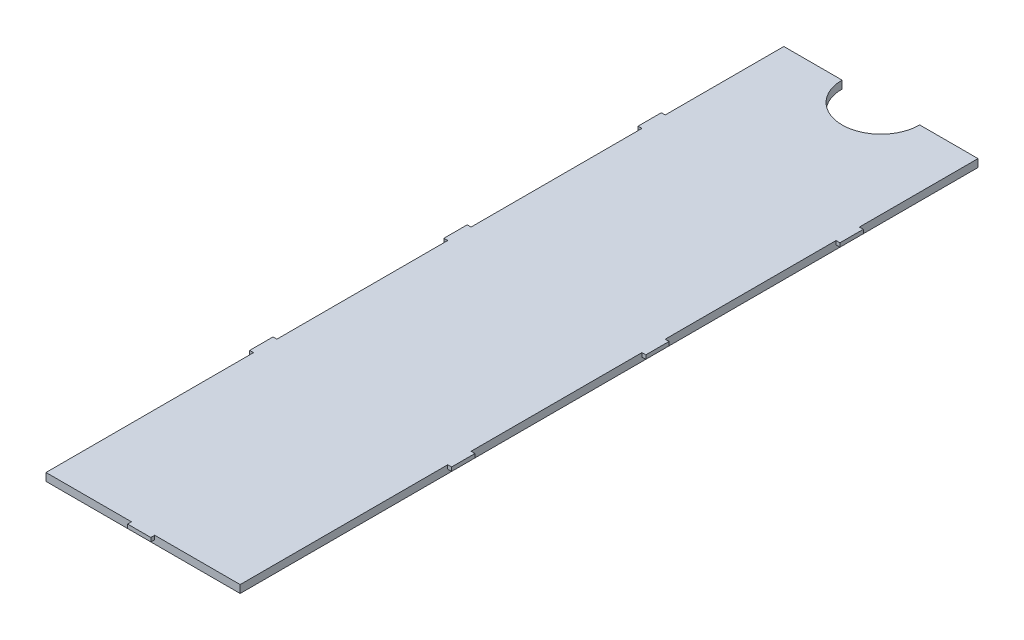
ISO-10303-21;
HEADER;
FILE_DESCRIPTION(('STEP AP214'),'2;1');
FILE_NAME('part.step','',(''),(''),'','','');
FILE_SCHEMA(('AUTOMOTIVE_DESIGN { 1 0 10303 214 1 1 1 1 }'));
ENDSEC;
DATA;
#1=APPLICATION_CONTEXT('core data for automotive mechanical design processes');
#2=APPLICATION_PROTOCOL_DEFINITION('international standard','automotive_design',2000,#1);
#3=PRODUCT_CONTEXT('',#1,'mechanical');
#4=PRODUCT('Part','Part','',(#3));
#5=PRODUCT_RELATED_PRODUCT_CATEGORY('part','',(#4));
#6=PRODUCT_DEFINITION_FORMATION('','',#4);
#7=PRODUCT_DEFINITION_CONTEXT('part definition',#1,'design');
#8=PRODUCT_DEFINITION('design','',#6,#7);
#9=PRODUCT_DEFINITION_SHAPE('','',#8);
#10=(LENGTH_UNIT() NAMED_UNIT(*) SI_UNIT(.MILLI.,.METRE.));
#11=(NAMED_UNIT(*) PLANE_ANGLE_UNIT() SI_UNIT($,.RADIAN.));
#12=(NAMED_UNIT(*) SI_UNIT($,.STERADIAN.) SOLID_ANGLE_UNIT());
#13=UNCERTAINTY_MEASURE_WITH_UNIT(LENGTH_MEASURE(1.E-05),#10,'distance_accuracy_value','');
#14=(GEOMETRIC_REPRESENTATION_CONTEXT(3) GLOBAL_UNCERTAINTY_ASSIGNED_CONTEXT((#13)) GLOBAL_UNIT_ASSIGNED_CONTEXT((#10,
#11,#12)) REPRESENTATION_CONTEXT('',''));
#15=CARTESIAN_POINT('',(0.,0.,0.));
#16=DIRECTION('',(0.,0.,1.));
#17=DIRECTION('',(1.,0.,0.));
#18=AXIS2_PLACEMENT_3D('',#15,#16,#17);
#19=CARTESIAN_POINT('',(0.,35.274050100301,1.80750317688863));
#20=DIRECTION('',(0.,0.,1.));
#21=DIRECTION('',(1.,0.,0.));
#22=AXIS2_PLACEMENT_3D('',#19,#20,#21);
#23=PLANE('',#22);
#24=DIRECTION('',(-1.,0.,0.));
#25=VECTOR('',#24,1.);
#26=CARTESIAN_POINT('',(0.,35.274050100301,1.80750317688863));
#27=LINE('',#26,#25);
#28=CARTESIAN_POINT('',(-86.6012572167533,35.274050100301,1.80750317688863));
#29=VERTEX_POINT('',#28);
#30=CARTESIAN_POINT('',(-94.1012572167536,35.274050100301,1.80750317688863));
#31=VERTEX_POINT('',#30);
#32=EDGE_CURVE('E284',#29,#31,#27,.T.);
#33=ORIENTED_EDGE('',*,*,#32,.F.);
#34=DIRECTION('',(0.,-1.,0.));
#35=VECTOR('',#34,1.);
#36=CARTESIAN_POINT('',(-86.6012572167533,35.274050100301,1.80750317688863));
#37=LINE('',#36,#35);
#38=CARTESIAN_POINT('',(-86.6012572167533,34.274050100301,1.80750317688863));
#39=VERTEX_POINT('',#38);
#40=EDGE_CURVE('E264',#29,#39,#37,.T.);
#41=ORIENTED_EDGE('',*,*,#40,.T.);
#42=DIRECTION('',(-1.,0.,0.));
#43=VECTOR('',#42,1.);
#44=CARTESIAN_POINT('',(0.,34.274050100301,1.80750317688863));
#45=LINE('',#44,#43);
#46=CARTESIAN_POINT('',(-94.1012572167536,34.274050100301,1.80750317688863));
#47=VERTEX_POINT('',#46);
#48=EDGE_CURVE('E303',#39,#47,#45,.T.);
#49=ORIENTED_EDGE('',*,*,#48,.T.);
#50=DIRECTION('',(0.,-1.,0.));
#51=VECTOR('',#50,1.);
#52=CARTESIAN_POINT('',(-94.1012572167536,35.274050100301,1.80750317688863));
#53=LINE('',#52,#51);
#54=EDGE_CURVE('E299',#31,#47,#53,.T.);
#55=ORIENTED_EDGE('',*,*,#54,.F.);
#56=EDGE_LOOP('',(#33,#41,#49,#55));
#57=FACE_BOUND('',#56,.T.);
#58=ADVANCED_FACE('F41',(#57),#23,.F.);
#59=CARTESIAN_POINT('',(-94.1012572167536,35.274050100301,0.));
#60=DIRECTION('',(1.,0.,0.));
#61=DIRECTION('',(0.,0.,-1.));
#62=AXIS2_PLACEMENT_3D('',#59,#60,#61);
#63=PLANE('',#62);
#64=DIRECTION('',(0.,0.,-1.));
#65=VECTOR('',#64,1.);
#66=CARTESIAN_POINT('',(-94.1012572167536,34.774050100301,0.));
#67=LINE('',#66,#65);
#68=CARTESIAN_POINT('',(-94.1012572167536,34.774050100301,20.0802620856482));
#69=VERTEX_POINT('',#68);
#70=CARTESIAN_POINT('',(-94.1012572167536,34.774050100301,17.0802620856482));
#71=VERTEX_POINT('',#70);
#72=EDGE_CURVE('E333',#69,#71,#67,.T.);
#73=ORIENTED_EDGE('',*,*,#72,.T.);
#74=DIRECTION('',(0.,1.,0.));
#75=VECTOR('',#74,1.);
#76=CARTESIAN_POINT('',(-94.1012572167536,35.274050100301,17.0802620856482));
#77=LINE('',#76,#75);
#78=CARTESIAN_POINT('',(-94.1012572167536,35.274050100301,17.0802620856482));
#79=VERTEX_POINT('',#78);
#80=EDGE_CURVE('E399',#71,#79,#77,.T.);
#81=ORIENTED_EDGE('',*,*,#80,.T.);
#82=DIRECTION('',(0.,0.,1.));
#83=VECTOR('',#82,1.);
#84=CARTESIAN_POINT('',(-94.1012572167536,35.274050100301,0.));
#85=LINE('',#84,#83);
#86=EDGE_CURVE('E289',#31,#79,#85,.T.);
#87=ORIENTED_EDGE('',*,*,#86,.F.);
#88=ORIENTED_EDGE('',*,*,#54,.T.);
#89=DIRECTION('',(0.,0.,1.));
#90=VECTOR('',#89,1.);
#91=CARTESIAN_POINT('',(-94.1012572167536,34.274050100301,0.));
#92=LINE('',#91,#90);
#93=CARTESIAN_POINT('',(-94.1012572167536,34.274050100301,96.8075031768886));
#94=VERTEX_POINT('',#93);
#95=EDGE_CURVE('E300',#47,#94,#92,.T.);
#96=ORIENTED_EDGE('',*,*,#95,.T.);
#97=DIRECTION('',(0.,-1.,0.));
#98=VECTOR('',#97,1.);
#99=CARTESIAN_POINT('',(-94.1012572167536,35.274050100301,96.8075031768886));
#100=LINE('',#99,#98);
#101=CARTESIAN_POINT('',(-94.1012572167536,35.274050100301,96.8075031768886));
#102=VERTEX_POINT('',#101);
#103=EDGE_CURVE('E311',#102,#94,#100,.T.);
#104=ORIENTED_EDGE('',*,*,#103,.F.);
#105=CARTESIAN_POINT('',(-94.1012572167536,35.274050100301,70.0802620856482));
#106=VERTEX_POINT('',#105);
#107=EDGE_CURVE('E310',#106,#102,#85,.T.);
#108=ORIENTED_EDGE('',*,*,#107,.F.);
#109=DIRECTION('',(0.,-1.,0.));
#110=VECTOR('',#109,1.);
#111=CARTESIAN_POINT('',(-94.1012572167536,35.274050100301,70.0802620856482));
#112=LINE('',#111,#110);
#113=CARTESIAN_POINT('',(-94.1012572167536,34.774050100301,70.0802620856482));
#114=VERTEX_POINT('',#113);
#115=EDGE_CURVE('E442',#106,#114,#112,.T.);
#116=ORIENTED_EDGE('',*,*,#115,.T.);
#117=DIRECTION('',(0.,0.,-1.));
#118=VECTOR('',#117,1.);
#119=CARTESIAN_POINT('',(-94.1012572167536,34.774050100301,0.));
#120=LINE('',#119,#118);
#121=CARTESIAN_POINT('',(-94.1012572167536,34.774050100301,67.0802620856482));
#122=VERTEX_POINT('',#121);
#123=EDGE_CURVE('E327',#114,#122,#120,.T.);
#124=ORIENTED_EDGE('',*,*,#123,.T.);
#125=DIRECTION('',(0.,1.,0.));
#126=VECTOR('',#125,1.);
#127=CARTESIAN_POINT('',(-94.1012572167536,35.274050100301,67.0802620856482));
#128=LINE('',#127,#126);
#129=CARTESIAN_POINT('',(-94.1012572167536,35.274050100301,67.0802620856482));
#130=VERTEX_POINT('',#129);
#131=EDGE_CURVE('E451',#122,#130,#128,.T.);
#132=ORIENTED_EDGE('',*,*,#131,.T.);
#133=CARTESIAN_POINT('',(-94.1012572167536,35.274050100301,45.0802620856482));
#134=VERTEX_POINT('',#133);
#135=EDGE_CURVE('E564',#134,#130,#85,.T.);
#136=ORIENTED_EDGE('',*,*,#135,.F.);
#137=DIRECTION('',(0.,-1.,0.));
#138=VECTOR('',#137,1.);
#139=CARTESIAN_POINT('',(-94.1012572167536,35.274050100301,45.0802620856482));
#140=LINE('',#139,#138);
#141=CARTESIAN_POINT('',(-94.1012572167536,34.774050100301,45.0802620856482));
#142=VERTEX_POINT('',#141);
#143=EDGE_CURVE('E416',#134,#142,#140,.T.);
#144=ORIENTED_EDGE('',*,*,#143,.T.);
#145=DIRECTION('',(0.,0.,-1.));
#146=VECTOR('',#145,1.);
#147=CARTESIAN_POINT('',(-94.1012572167536,34.774050100301,0.));
#148=LINE('',#147,#146);
#149=CARTESIAN_POINT('',(-94.1012572167536,34.774050100301,42.0802620856482));
#150=VERTEX_POINT('',#149);
#151=EDGE_CURVE('E330',#142,#150,#148,.T.);
#152=ORIENTED_EDGE('',*,*,#151,.T.);
#153=DIRECTION('',(0.,1.,0.));
#154=VECTOR('',#153,1.);
#155=CARTESIAN_POINT('',(-94.1012572167536,35.274050100301,42.0802620856482));
#156=LINE('',#155,#154);
#157=CARTESIAN_POINT('',(-94.1012572167536,35.274050100301,42.0802620856482));
#158=VERTEX_POINT('',#157);
#159=EDGE_CURVE('E425',#150,#158,#156,.T.);
#160=ORIENTED_EDGE('',*,*,#159,.T.);
#161=CARTESIAN_POINT('',(-94.1012572167536,35.274050100301,20.0802620856482));
#162=VERTEX_POINT('',#161);
#163=EDGE_CURVE('E563',#162,#158,#85,.T.);
#164=ORIENTED_EDGE('',*,*,#163,.F.);
#165=DIRECTION('',(0.,-1.,0.));
#166=VECTOR('',#165,1.);
#167=CARTESIAN_POINT('',(-94.1012572167536,35.274050100301,20.0802620856482));
#168=LINE('',#167,#166);
#169=EDGE_CURVE('E391',#162,#69,#168,.T.);
#170=ORIENTED_EDGE('',*,*,#169,.T.);
#171=EDGE_LOOP('',(#73,#81,#87,#88,#96,#104,#108,#116,#124,#132,#136,#144,#152,#160,#164,#170));
#172=FACE_BOUND('',#171,.T.);
#173=ADVANCED_FACE('F43',(#172),#63,.F.);
#174=CARTESIAN_POINT('',(0.,35.274050100301,96.8075031768886));
#175=DIRECTION('',(0.,0.,-1.));
#176=DIRECTION('',(-1.,0.,0.));
#177=AXIS2_PLACEMENT_3D('',#174,#175,#176);
#178=PLANE('',#177);
#179=DIRECTION('',(1.,0.,0.));
#180=VECTOR('',#179,1.);
#181=CARTESIAN_POINT('',(0.,35.274050100301,96.8075031768886));
#182=LINE('',#181,#180);
#183=CARTESIAN_POINT('',(-80.1012572167533,35.274050100301,96.8075031768886));
#184=VERTEX_POINT('',#183);
#185=CARTESIAN_POINT('',(-69.1012572167529,35.274050100301,96.8075031768886));
#186=VERTEX_POINT('',#185);
#187=EDGE_CURVE('E294',#184,#186,#182,.T.);
#188=ORIENTED_EDGE('',*,*,#187,.F.);
#189=DIRECTION('',(0.,-1.,0.));
#190=VECTOR('',#189,1.);
#191=CARTESIAN_POINT('',(-80.1012572167533,35.274050100301,96.8075031768886));
#192=LINE('',#191,#190);
#193=CARTESIAN_POINT('',(-80.1012572167533,34.774050100301,96.8075031768886));
#194=VERTEX_POINT('',#193);
#195=EDGE_CURVE('E476',#184,#194,#192,.T.);
#196=ORIENTED_EDGE('',*,*,#195,.T.);
#197=DIRECTION('',(-1.,0.,0.));
#198=VECTOR('',#197,1.);
#199=CARTESIAN_POINT('',(0.,34.774050100301,96.8075031768886));
#200=LINE('',#199,#198);
#201=CARTESIAN_POINT('',(-83.1012572167533,34.774050100301,96.8075031768886));
#202=VERTEX_POINT('',#201);
#203=EDGE_CURVE('E324',#194,#202,#200,.T.);
#204=ORIENTED_EDGE('',*,*,#203,.T.);
#205=DIRECTION('',(0.,1.,0.));
#206=VECTOR('',#205,1.);
#207=CARTESIAN_POINT('',(-83.1012572167533,35.274050100301,96.8075031768886));
#208=LINE('',#207,#206);
#209=CARTESIAN_POINT('',(-83.1012572167533,35.274050100301,96.8075031768886));
#210=VERTEX_POINT('',#209);
#211=EDGE_CURVE('E468',#202,#210,#208,.T.);
#212=ORIENTED_EDGE('',*,*,#211,.T.);
#213=EDGE_CURVE('E296',#102,#210,#182,.T.);
#214=ORIENTED_EDGE('',*,*,#213,.F.);
#215=ORIENTED_EDGE('',*,*,#103,.T.);
#216=DIRECTION('',(1.,0.,0.));
#217=VECTOR('',#216,1.);
#218=CARTESIAN_POINT('',(0.,34.274050100301,96.8075031768886));
#219=LINE('',#218,#217);
#220=CARTESIAN_POINT('',(-69.1012572167529,34.274050100301,96.8075031768886));
#221=VERTEX_POINT('',#220);
#222=EDGE_CURVE('E308',#94,#221,#219,.T.);
#223=ORIENTED_EDGE('',*,*,#222,.T.);
#224=DIRECTION('',(0.,-1.,0.));
#225=VECTOR('',#224,1.);
#226=CARTESIAN_POINT('',(-69.1012572167529,35.274050100301,96.8075031768886));
#227=LINE('',#226,#225);
#228=EDGE_CURVE('E315',#186,#221,#227,.T.);
#229=ORIENTED_EDGE('',*,*,#228,.F.);
#230=EDGE_LOOP('',(#188,#196,#204,#212,#214,#215,#223,#229));
#231=FACE_BOUND('',#230,.T.);
#232=ADVANCED_FACE('F603',(#231),#178,.F.);
#233=CARTESIAN_POINT('',(-69.1012572167529,35.274050100301,0.));
#234=DIRECTION('',(-1.,0.,0.));
#235=DIRECTION('',(0.,0.,1.));
#236=AXIS2_PLACEMENT_3D('',#233,#234,#235);
#237=PLANE('',#236);
#238=DIRECTION('',(0.,0.,-1.));
#239=VECTOR('',#238,1.);
#240=CARTESIAN_POINT('',(-69.1012572167529,35.274050100301,0.));
#241=LINE('',#240,#239);
#242=CARTESIAN_POINT('',(-69.1012572167529,35.274050100301,67.0802620856482));
#243=VERTEX_POINT('',#242);
#244=CARTESIAN_POINT('',(-69.1012572167529,35.274050100301,45.0802620856482));
#245=VERTEX_POINT('',#244);
#246=EDGE_CURVE('E295',#243,#245,#241,.T.);
#247=ORIENTED_EDGE('',*,*,#246,.F.);
#248=DIRECTION('',(0.,-1.,0.));
#249=VECTOR('',#248,1.);
#250=CARTESIAN_POINT('',(-69.1012572167529,35.274050100301,67.0802620856482));
#251=LINE('',#250,#249);
#252=CARTESIAN_POINT('',(-69.1012572167529,34.774050100301,67.0802620856482));
#253=VERTEX_POINT('',#252);
#254=EDGE_CURVE('E526',#243,#253,#251,.T.);
#255=ORIENTED_EDGE('',*,*,#254,.T.);
#256=DIRECTION('',(0.,0.,1.));
#257=VECTOR('',#256,1.);
#258=CARTESIAN_POINT('',(-69.1012572167529,34.774050100301,0.));
#259=LINE('',#258,#257);
#260=CARTESIAN_POINT('',(-69.1012572167529,34.774050100301,70.0802620856482));
#261=VERTEX_POINT('',#260);
#262=EDGE_CURVE('E11',#253,#261,#259,.T.);
#263=ORIENTED_EDGE('',*,*,#262,.T.);
#264=DIRECTION('',(0.,1.,0.));
#265=VECTOR('',#264,1.);
#266=CARTESIAN_POINT('',(-69.1012572167529,35.274050100301,70.0802620856482));
#267=LINE('',#266,#265);
#268=CARTESIAN_POINT('',(-69.1012572167529,35.274050100301,70.0802620856482));
#269=VERTEX_POINT('',#268);
#270=EDGE_CURVE('E529',#261,#269,#267,.T.);
#271=ORIENTED_EDGE('',*,*,#270,.T.);
#272=EDGE_CURVE('E288',#186,#269,#241,.T.);
#273=ORIENTED_EDGE('',*,*,#272,.F.);
#274=ORIENTED_EDGE('',*,*,#228,.T.);
#275=DIRECTION('',(0.,0.,-1.));
#276=VECTOR('',#275,1.);
#277=CARTESIAN_POINT('',(-69.1012572167529,34.274050100301,0.));
#278=LINE('',#277,#276);
#279=CARTESIAN_POINT('',(-69.1012572167529,34.274050100301,1.80750317688863));
#280=VERTEX_POINT('',#279);
#281=EDGE_CURVE('E306',#221,#280,#278,.T.);
#282=ORIENTED_EDGE('',*,*,#281,.T.);
#283=DIRECTION('',(0.,-1.,0.));
#284=VECTOR('',#283,1.);
#285=CARTESIAN_POINT('',(-69.1012572167529,35.274050100301,1.80750317688863));
#286=LINE('',#285,#284);
#287=CARTESIAN_POINT('',(-69.1012572167529,35.274050100301,1.80750317688863));
#288=VERTEX_POINT('',#287);
#289=EDGE_CURVE('E318',#288,#280,#286,.T.);
#290=ORIENTED_EDGE('',*,*,#289,.F.);
#291=CARTESIAN_POINT('',(-69.1012572167529,35.274050100301,17.0802620856482));
#292=VERTEX_POINT('',#291);
#293=EDGE_CURVE('E282',#292,#288,#241,.T.);
#294=ORIENTED_EDGE('',*,*,#293,.F.);
#295=DIRECTION('',(0.,-1.,0.));
#296=VECTOR('',#295,1.);
#297=CARTESIAN_POINT('',(-69.1012572167529,35.274050100301,17.0802620856482));
#298=LINE('',#297,#296);
#299=CARTESIAN_POINT('',(-69.1012572167529,34.774050100301,17.0802620856482));
#300=VERTEX_POINT('',#299);
#301=EDGE_CURVE('E304',#292,#300,#298,.T.);
#302=ORIENTED_EDGE('',*,*,#301,.T.);
#303=DIRECTION('',(0.,0.,1.));
#304=VECTOR('',#303,1.);
#305=CARTESIAN_POINT('',(-69.1012572167529,34.774050100301,0.));
#306=LINE('',#305,#304);
#307=CARTESIAN_POINT('',(-69.1012572167529,34.774050100301,20.0802620856482));
#308=VERTEX_POINT('',#307);
#309=EDGE_CURVE('E314',#300,#308,#306,.T.);
#310=ORIENTED_EDGE('',*,*,#309,.T.);
#311=DIRECTION('',(0.,1.,0.));
#312=VECTOR('',#311,1.);
#313=CARTESIAN_POINT('',(-69.1012572167529,35.274050100301,20.0802620856482));
#314=LINE('',#313,#312);
#315=CARTESIAN_POINT('',(-69.1012572167529,35.274050100301,20.0802620856482));
#316=VERTEX_POINT('',#315);
#317=EDGE_CURVE('E498',#308,#316,#314,.T.);
#318=ORIENTED_EDGE('',*,*,#317,.T.);
#319=CARTESIAN_POINT('',(-69.1012572167529,35.274050100301,42.0802620856482));
#320=VERTEX_POINT('',#319);
#321=EDGE_CURVE('E286',#320,#316,#241,.T.);
#322=ORIENTED_EDGE('',*,*,#321,.F.);
#323=DIRECTION('',(0.,-1.,0.));
#324=VECTOR('',#323,1.);
#325=CARTESIAN_POINT('',(-69.1012572167529,35.274050100301,42.0802620856482));
#326=LINE('',#325,#324);
#327=CARTESIAN_POINT('',(-69.1012572167529,34.774050100301,42.0802620856482));
#328=VERTEX_POINT('',#327);
#329=EDGE_CURVE('E344',#320,#328,#326,.T.);
#330=ORIENTED_EDGE('',*,*,#329,.T.);
#331=DIRECTION('',(0.,0.,1.));
#332=VECTOR('',#331,1.);
#333=CARTESIAN_POINT('',(-69.1012572167529,34.774050100301,0.));
#334=LINE('',#333,#332);
#335=CARTESIAN_POINT('',(-69.1012572167529,34.774050100301,45.0802620856482));
#336=VERTEX_POINT('',#335);
#337=EDGE_CURVE('E49',#328,#336,#334,.T.);
#338=ORIENTED_EDGE('',*,*,#337,.T.);
#339=DIRECTION('',(0.,1.,0.));
#340=VECTOR('',#339,1.);
#341=CARTESIAN_POINT('',(-69.1012572167529,35.274050100301,45.0802620856482));
#342=LINE('',#341,#340);
#343=EDGE_CURVE('E342',#336,#245,#342,.T.);
#344=ORIENTED_EDGE('',*,*,#343,.T.);
#345=EDGE_LOOP('',(#247,#255,#263,#271,#273,#274,#282,#290,#294,#302,#310,#318,#322,#330,#338,#344));
#346=FACE_BOUND('',#345,.T.);
#347=ADVANCED_FACE('F340',(#346),#237,.F.);
#348=CARTESIAN_POINT('',(-76.6012572167533,34.274050100301,1.80750317688863));
#349=VERTEX_POINT('',#348);
#350=EDGE_CURVE('E277',#280,#349,#45,.T.);
#351=ORIENTED_EDGE('',*,*,#350,.T.);
#352=DIRECTION('',(0.,-1.,0.));
#353=VECTOR('',#352,1.);
#354=CARTESIAN_POINT('',(-76.6012572167533,35.274050100301,1.80750317688863));
#355=LINE('',#354,#353);
#356=CARTESIAN_POINT('',(-76.6012572167533,35.274050100301,1.80750317688863));
#357=VERTEX_POINT('',#356);
#358=EDGE_CURVE('E56',#349,#357,#355,.F.);
#359=ORIENTED_EDGE('',*,*,#358,.T.);
#360=EDGE_CURVE('E275',#288,#357,#27,.T.);
#361=ORIENTED_EDGE('',*,*,#360,.F.);
#362=ORIENTED_EDGE('',*,*,#289,.T.);
#363=EDGE_LOOP('',(#351,#359,#361,#362));
#364=FACE_BOUND('',#363,.T.);
#365=ADVANCED_FACE('F273',(#364),#23,.F.);
#366=CARTESIAN_POINT('',(0.,35.274050100301,0.));
#367=DIRECTION('',(0.,-1.,0.));
#368=DIRECTION('',(0.,0.,-1.));
#369=AXIS2_PLACEMENT_3D('',#366,#367,#368);
#370=PLANE('',#369);
#371=ORIENTED_EDGE('',*,*,#360,.T.);
#372=CARTESIAN_POINT('',(-81.6012572167533,35.274050100301,1.80750317688863));
#373=DIRECTION('',(0.,-1.,0.));
#374=DIRECTION('',(0.,0.,-1.));
#375=AXIS2_PLACEMENT_3D('',#372,#373,#374);
#376=CIRCLE('',#375,5.);
#377=EDGE_CURVE('E261',#357,#29,#376,.T.);
#378=ORIENTED_EDGE('',*,*,#377,.T.);
#379=ORIENTED_EDGE('',*,*,#32,.T.);
#380=ORIENTED_EDGE('',*,*,#86,.T.);
#381=DIRECTION('',(1.,0.,0.));
#382=VECTOR('',#381,1.);
#383=CARTESIAN_POINT('',(-94.6012572167536,35.274050100301,17.0802620856482));
#384=LINE('',#383,#382);
#385=CARTESIAN_POINT('',(-94.6012572167536,35.274050100301,17.0802620856482));
#386=VERTEX_POINT('',#385);
#387=EDGE_CURVE('E387',#386,#79,#384,.T.);
#388=ORIENTED_EDGE('',*,*,#387,.F.);
#389=DIRECTION('',(0.,0.,-1.));
#390=VECTOR('',#389,1.);
#391=CARTESIAN_POINT('',(-94.6012572167536,35.274050100301,17.0802620856482));
#392=LINE('',#391,#390);
#393=CARTESIAN_POINT('',(-94.6012572167536,35.274050100301,20.0802620856482));
#394=VERTEX_POINT('',#393);
#395=EDGE_CURVE('E381',#394,#386,#392,.T.);
#396=ORIENTED_EDGE('',*,*,#395,.F.);
#397=DIRECTION('',(-1.,0.,0.));
#398=VECTOR('',#397,1.);
#399=CARTESIAN_POINT('',(-94.6012572167536,35.274050100301,20.0802620856482));
#400=LINE('',#399,#398);
#401=EDGE_CURVE('E394',#162,#394,#400,.T.);
#402=ORIENTED_EDGE('',*,*,#401,.F.);
#403=ORIENTED_EDGE('',*,*,#163,.T.);
#404=DIRECTION('',(1.,0.,0.));
#405=VECTOR('',#404,1.);
#406=CARTESIAN_POINT('',(-94.6012572167536,35.274050100301,42.0802620856482));
#407=LINE('',#406,#405);
#408=CARTESIAN_POINT('',(-94.6012572167536,35.274050100301,42.0802620856482));
#409=VERTEX_POINT('',#408);
#410=EDGE_CURVE('E412',#409,#158,#407,.T.);
#411=ORIENTED_EDGE('',*,*,#410,.F.);
#412=DIRECTION('',(0.,0.,-1.));
#413=VECTOR('',#412,1.);
#414=CARTESIAN_POINT('',(-94.6012572167536,35.274050100301,42.0802620856482));
#415=LINE('',#414,#413);
#416=CARTESIAN_POINT('',(-94.6012572167536,35.274050100301,45.0802620856482));
#417=VERTEX_POINT('',#416);
#418=EDGE_CURVE('E406',#417,#409,#415,.T.);
#419=ORIENTED_EDGE('',*,*,#418,.F.);
#420=DIRECTION('',(-1.,0.,0.));
#421=VECTOR('',#420,1.);
#422=CARTESIAN_POINT('',(-94.6012572167536,35.274050100301,45.0802620856482));
#423=LINE('',#422,#421);
#424=EDGE_CURVE('E419',#134,#417,#423,.T.);
#425=ORIENTED_EDGE('',*,*,#424,.F.);
#426=ORIENTED_EDGE('',*,*,#135,.T.);
#427=DIRECTION('',(1.,0.,0.));
#428=VECTOR('',#427,1.);
#429=CARTESIAN_POINT('',(-94.6012572167536,35.274050100301,67.0802620856482));
#430=LINE('',#429,#428);
#431=CARTESIAN_POINT('',(-94.6012572167536,35.274050100301,67.0802620856482));
#432=VERTEX_POINT('',#431);
#433=EDGE_CURVE('E438',#432,#130,#430,.T.);
#434=ORIENTED_EDGE('',*,*,#433,.F.);
#435=DIRECTION('',(0.,0.,-1.));
#436=VECTOR('',#435,1.);
#437=CARTESIAN_POINT('',(-94.6012572167536,35.274050100301,67.0802620856482));
#438=LINE('',#437,#436);
#439=CARTESIAN_POINT('',(-94.6012572167536,35.274050100301,70.0802620856482));
#440=VERTEX_POINT('',#439);
#441=EDGE_CURVE('E432',#440,#432,#438,.T.);
#442=ORIENTED_EDGE('',*,*,#441,.F.);
#443=DIRECTION('',(-1.,0.,0.));
#444=VECTOR('',#443,1.);
#445=CARTESIAN_POINT('',(-94.6012572167536,35.274050100301,70.0802620856482));
#446=LINE('',#445,#444);
#447=EDGE_CURVE('E445',#106,#440,#446,.T.);
#448=ORIENTED_EDGE('',*,*,#447,.F.);
#449=ORIENTED_EDGE('',*,*,#107,.T.);
#450=ORIENTED_EDGE('',*,*,#213,.T.);
#451=DIRECTION('',(0.,0.,-1.));
#452=VECTOR('',#451,1.);
#453=CARTESIAN_POINT('',(-83.1012572167533,35.274050100301,96.3075031768883));
#454=LINE('',#453,#452);
#455=CARTESIAN_POINT('',(-83.1012572167533,35.274050100301,97.3075031768886));
#456=VERTEX_POINT('',#455);
#457=EDGE_CURVE('E458',#456,#210,#454,.T.);
#458=ORIENTED_EDGE('',*,*,#457,.F.);
#459=DIRECTION('',(-1.,0.,0.));
#460=VECTOR('',#459,1.);
#461=CARTESIAN_POINT('',(-80.1012572167533,35.274050100301,97.3075031768886));
#462=LINE('',#461,#460);
#463=CARTESIAN_POINT('',(-80.1012572167533,35.274050100301,97.3075031768886));
#464=VERTEX_POINT('',#463);
#465=EDGE_CURVE('E470',#464,#456,#462,.T.);
#466=ORIENTED_EDGE('',*,*,#465,.F.);
#467=DIRECTION('',(0.,0.,1.));
#468=VECTOR('',#467,1.);
#469=CARTESIAN_POINT('',(-80.1012572167533,35.274050100301,96.3075031768883));
#470=LINE('',#469,#468);
#471=EDGE_CURVE('E463',#184,#464,#470,.T.);
#472=ORIENTED_EDGE('',*,*,#471,.F.);
#473=ORIENTED_EDGE('',*,*,#187,.T.);
#474=ORIENTED_EDGE('',*,*,#272,.T.);
#475=DIRECTION('',(-1.,0.,0.));
#476=VECTOR('',#475,1.);
#477=CARTESIAN_POINT('',(-68.6012572167529,35.274050100301,70.0802620856482));
#478=LINE('',#477,#476);
#479=CARTESIAN_POINT('',(-68.6012572167529,35.274050100301,70.0802620856482));
#480=VERTEX_POINT('',#479);
#481=EDGE_CURVE('E537',#480,#269,#478,.T.);
#482=ORIENTED_EDGE('',*,*,#481,.F.);
#483=DIRECTION('',(0.,0.,1.));
#484=VECTOR('',#483,1.);
#485=CARTESIAN_POINT('',(-68.6012572167529,35.274050100301,67.0802620856482));
#486=LINE('',#485,#484);
#487=CARTESIAN_POINT('',(-68.6012572167529,35.274050100301,67.0802620856482));
#488=VERTEX_POINT('',#487);
#489=EDGE_CURVE('E533',#488,#480,#486,.T.);
#490=ORIENTED_EDGE('',*,*,#489,.F.);
#491=DIRECTION('',(1.,0.,0.));
#492=VECTOR('',#491,1.);
#493=CARTESIAN_POINT('',(-68.6012572167529,35.274050100301,67.0802620856482));
#494=LINE('',#493,#492);
#495=EDGE_CURVE('E521',#243,#488,#494,.T.);
#496=ORIENTED_EDGE('',*,*,#495,.F.);
#497=ORIENTED_EDGE('',*,*,#246,.T.);
#498=DIRECTION('',(-1.,0.,0.));
#499=VECTOR('',#498,1.);
#500=CARTESIAN_POINT('',(-68.6012572167529,35.274050100301,45.0802620856482));
#501=LINE('',#500,#499);
#502=CARTESIAN_POINT('',(-68.6012572167529,35.274050100301,45.0802620856482));
#503=VERTEX_POINT('',#502);
#504=EDGE_CURVE('E364',#503,#245,#501,.T.);
#505=ORIENTED_EDGE('',*,*,#504,.F.);
#506=DIRECTION('',(0.,0.,1.));
#507=VECTOR('',#506,1.);
#508=CARTESIAN_POINT('',(-68.6012572167529,35.274050100301,42.0802620856482));
#509=LINE('',#508,#507);
#510=CARTESIAN_POINT('',(-68.6012572167529,35.274050100301,42.0802620856482));
#511=VERTEX_POINT('',#510);
#512=EDGE_CURVE('E359',#511,#503,#509,.T.);
#513=ORIENTED_EDGE('',*,*,#512,.F.);
#514=DIRECTION('',(1.,0.,0.));
#515=VECTOR('',#514,1.);
#516=CARTESIAN_POINT('',(-68.6012572167529,35.274050100301,42.0802620856482));
#517=LINE('',#516,#515);
#518=EDGE_CURVE('E370',#320,#511,#517,.T.);
#519=ORIENTED_EDGE('',*,*,#518,.F.);
#520=ORIENTED_EDGE('',*,*,#321,.T.);
#521=DIRECTION('',(-1.,0.,0.));
#522=VECTOR('',#521,1.);
#523=CARTESIAN_POINT('',(-68.6012572167529,35.274050100301,20.0802620856482));
#524=LINE('',#523,#522);
#525=CARTESIAN_POINT('',(-68.6012572167529,35.274050100301,20.0802620856482));
#526=VERTEX_POINT('',#525);
#527=EDGE_CURVE('E483',#526,#316,#524,.T.);
#528=ORIENTED_EDGE('',*,*,#527,.F.);
#529=DIRECTION('',(0.,0.,1.));
#530=VECTOR('',#529,1.);
#531=CARTESIAN_POINT('',(-68.6012572167529,35.274050100301,17.0802620856482));
#532=LINE('',#531,#530);
#533=CARTESIAN_POINT('',(-68.6012572167529,35.274050100301,17.0802620856482));
#534=VERTEX_POINT('',#533);
#535=EDGE_CURVE('E480',#534,#526,#532,.T.);
#536=ORIENTED_EDGE('',*,*,#535,.F.);
#537=DIRECTION('',(1.,0.,0.));
#538=VECTOR('',#537,1.);
#539=CARTESIAN_POINT('',(-68.6012572167529,35.274050100301,17.0802620856482));
#540=LINE('',#539,#538);
#541=EDGE_CURVE('E487',#292,#534,#540,.T.);
#542=ORIENTED_EDGE('',*,*,#541,.F.);
#543=ORIENTED_EDGE('',*,*,#293,.T.);
#544=EDGE_LOOP('',(#371,#378,#379,#380,#388,#396,#402,#403,#411,#419,#425,#426,#434,#442,#448,
#449,#450,#458,#466,#472,#473,#474,#482,#490,#496,#497,#505,#513,#519,#520,#528,#536,#542,#543));
#545=FACE_BOUND('',#544,.T.);
#546=ADVANCED_FACE('F279',(#545),#370,.F.);
#547=CARTESIAN_POINT('',(0.,34.274050100301,0.));
#548=DIRECTION('',(0.,-1.,0.));
#549=DIRECTION('',(0.,0.,-1.));
#550=AXIS2_PLACEMENT_3D('',#547,#548,#549);
#551=PLANE('',#550);
#552=CARTESIAN_POINT('',(-81.6012572167533,34.274050100301,1.80750317688863));
#553=DIRECTION('',(0.,-1.,0.));
#554=DIRECTION('',(0.,0.,-1.));
#555=AXIS2_PLACEMENT_3D('',#552,#553,#554);
#556=CIRCLE('',#555,5.);
#557=EDGE_CURVE('E268',#349,#39,#556,.T.);
#558=ORIENTED_EDGE('',*,*,#557,.F.);
#559=ORIENTED_EDGE('',*,*,#350,.F.);
#560=ORIENTED_EDGE('',*,*,#281,.F.);
#561=ORIENTED_EDGE('',*,*,#222,.F.);
#562=ORIENTED_EDGE('',*,*,#95,.F.);
#563=ORIENTED_EDGE('',*,*,#48,.F.);
#564=EDGE_LOOP('',(#558,#559,#560,#561,#562,#563));
#565=FACE_BOUND('',#564,.T.);
#566=ADVANCED_FACE('F554',(#565),#551,.T.);
#567=CARTESIAN_POINT('',(0.,34.774050100301,0.));
#568=DIRECTION('',(0.,-1.,0.));
#569=DIRECTION('',(0.,0.,-1.));
#570=AXIS2_PLACEMENT_3D('',#567,#568,#569);
#571=PLANE('',#570);
#572=ORIENTED_EDGE('',*,*,#309,.F.);
#573=DIRECTION('',(1.,0.,0.));
#574=VECTOR('',#573,1.);
#575=CARTESIAN_POINT('',(-68.6012572167529,34.774050100301,17.0802620856482));
#576=LINE('',#575,#574);
#577=CARTESIAN_POINT('',(-68.6012572167529,34.774050100301,17.0802620856482));
#578=VERTEX_POINT('',#577);
#579=EDGE_CURVE('E484',#300,#578,#576,.T.);
#580=ORIENTED_EDGE('',*,*,#579,.T.);
#581=DIRECTION('',(0.,0.,1.));
#582=VECTOR('',#581,1.);
#583=CARTESIAN_POINT('',(-68.6012572167529,34.774050100301,17.0802620856482));
#584=LINE('',#583,#582);
#585=CARTESIAN_POINT('',(-68.6012572167529,34.774050100301,20.0802620856482));
#586=VERTEX_POINT('',#585);
#587=EDGE_CURVE('E479',#578,#586,#584,.T.);
#588=ORIENTED_EDGE('',*,*,#587,.T.);
#589=DIRECTION('',(-1.,0.,0.));
#590=VECTOR('',#589,1.);
#591=CARTESIAN_POINT('',(-68.6012572167529,34.774050100301,20.0802620856482));
#592=LINE('',#591,#590);
#593=EDGE_CURVE('E492',#586,#308,#592,.T.);
#594=ORIENTED_EDGE('',*,*,#593,.T.);
#595=EDGE_LOOP('',(#572,#580,#588,#594));
#596=FACE_BOUND('',#595,.T.);
#597=ADVANCED_FACE('F513',(#596),#571,.T.);
#598=CARTESIAN_POINT('',(-68.6012572167529,35.274050100301,17.0802620856482));
#599=DIRECTION('',(0.,0.,-1.));
#600=DIRECTION('',(-1.,0.,0.));
#601=AXIS2_PLACEMENT_3D('',#598,#599,#600);
#602=PLANE('',#601);
#603=ORIENTED_EDGE('',*,*,#301,.F.);
#604=ORIENTED_EDGE('',*,*,#541,.T.);
#605=DIRECTION('',(0.,-1.,0.));
#606=VECTOR('',#605,1.);
#607=CARTESIAN_POINT('',(-68.6012572167529,35.274050100301,17.0802620856482));
#608=LINE('',#607,#606);
#609=EDGE_CURVE('E495',#534,#578,#608,.T.);
#610=ORIENTED_EDGE('',*,*,#609,.T.);
#611=ORIENTED_EDGE('',*,*,#579,.F.);
#612=EDGE_LOOP('',(#603,#604,#610,#611));
#613=FACE_BOUND('',#612,.T.);
#614=ADVANCED_FACE('F504',(#613),#602,.T.);
#615=CARTESIAN_POINT('',(-68.6012572167529,35.274050100301,20.0802620856482));
#616=DIRECTION('',(0.,0.,1.));
#617=DIRECTION('',(1.,0.,0.));
#618=AXIS2_PLACEMENT_3D('',#615,#616,#617);
#619=PLANE('',#618);
#620=ORIENTED_EDGE('',*,*,#317,.F.);
#621=ORIENTED_EDGE('',*,*,#593,.F.);
#622=DIRECTION('',(0.,-1.,0.));
#623=VECTOR('',#622,1.);
#624=CARTESIAN_POINT('',(-68.6012572167529,35.274050100301,20.0802620856482));
#625=LINE('',#624,#623);
#626=EDGE_CURVE('E489',#526,#586,#625,.T.);
#627=ORIENTED_EDGE('',*,*,#626,.F.);
#628=ORIENTED_EDGE('',*,*,#527,.T.);
#629=EDGE_LOOP('',(#620,#621,#627,#628));
#630=FACE_BOUND('',#629,.T.);
#631=ADVANCED_FACE('F516',(#630),#619,.T.);
#632=CARTESIAN_POINT('',(-68.6012572167529,35.274050100301,17.0802620856482));
#633=DIRECTION('',(1.,0.,0.));
#634=DIRECTION('',(0.,0.,-1.));
#635=AXIS2_PLACEMENT_3D('',#632,#633,#634);
#636=PLANE('',#635);
#637=ORIENTED_EDGE('',*,*,#587,.F.);
#638=ORIENTED_EDGE('',*,*,#609,.F.);
#639=ORIENTED_EDGE('',*,*,#535,.T.);
#640=ORIENTED_EDGE('',*,*,#626,.T.);
#641=EDGE_LOOP('',(#637,#638,#639,#640));
#642=FACE_BOUND('',#641,.T.);
#643=ADVANCED_FACE('F510',(#642),#636,.T.);
#644=CARTESIAN_POINT('',(0.,34.774050100301,0.));
#645=DIRECTION('',(0.,-1.,0.));
#646=DIRECTION('',(0.,0.,-1.));
#647=AXIS2_PLACEMENT_3D('',#644,#645,#646);
#648=PLANE('',#647);
#649=ORIENTED_EDGE('',*,*,#203,.F.);
#650=DIRECTION('',(0.,0.,1.));
#651=VECTOR('',#650,1.);
#652=CARTESIAN_POINT('',(-80.1012572167533,34.774050100301,96.3075031768883));
#653=LINE('',#652,#651);
#654=CARTESIAN_POINT('',(-80.1012572167533,34.774050100301,97.3075031768886));
#655=VERTEX_POINT('',#654);
#656=EDGE_CURVE('E466',#194,#655,#653,.T.);
#657=ORIENTED_EDGE('',*,*,#656,.T.);
#658=DIRECTION('',(-1.,0.,0.));
#659=VECTOR('',#658,1.);
#660=CARTESIAN_POINT('',(-80.1012572167533,34.774050100301,97.3075031768886));
#661=LINE('',#660,#659);
#662=CARTESIAN_POINT('',(-83.1012572167533,34.774050100301,97.3075031768886));
#663=VERTEX_POINT('',#662);
#664=EDGE_CURVE('E462',#655,#663,#661,.T.);
#665=ORIENTED_EDGE('',*,*,#664,.T.);
#666=DIRECTION('',(0.,0.,-1.));
#667=VECTOR('',#666,1.);
#668=CARTESIAN_POINT('',(-83.1012572167533,34.774050100301,96.3075031768883));
#669=LINE('',#668,#667);
#670=EDGE_CURVE('E460',#663,#202,#669,.T.);
#671=ORIENTED_EDGE('',*,*,#670,.T.);
#672=EDGE_LOOP('',(#649,#657,#665,#671));
#673=FACE_BOUND('',#672,.T.);
#674=ADVANCED_FACE('F621',(#673),#648,.T.);
#675=CARTESIAN_POINT('',(-80.1012572167533,35.274050100301,96.3075031768883));
#676=DIRECTION('',(1.,0.,0.));
#677=DIRECTION('',(0.,0.,-1.));
#678=AXIS2_PLACEMENT_3D('',#675,#676,#677);
#679=PLANE('',#678);
#680=ORIENTED_EDGE('',*,*,#195,.F.);
#681=ORIENTED_EDGE('',*,*,#471,.T.);
#682=DIRECTION('',(0.,-1.,0.));
#683=VECTOR('',#682,1.);
#684=CARTESIAN_POINT('',(-80.1012572167533,35.274050100301,97.3075031768886));
#685=LINE('',#684,#683);
#686=EDGE_CURVE('E455',#464,#655,#685,.T.);
#687=ORIENTED_EDGE('',*,*,#686,.T.);
#688=ORIENTED_EDGE('',*,*,#656,.F.);
#689=EDGE_LOOP('',(#680,#681,#687,#688));
#690=FACE_BOUND('',#689,.T.);
#691=ADVANCED_FACE('F629',(#690),#679,.T.);
#692=CARTESIAN_POINT('',(-83.1012572167533,35.274050100301,96.3075031768883));
#693=DIRECTION('',(-1.,0.,0.));
#694=DIRECTION('',(0.,0.,1.));
#695=AXIS2_PLACEMENT_3D('',#692,#693,#694);
#696=PLANE('',#695);
#697=ORIENTED_EDGE('',*,*,#211,.F.);
#698=ORIENTED_EDGE('',*,*,#670,.F.);
#699=DIRECTION('',(0.,-1.,0.));
#700=VECTOR('',#699,1.);
#701=CARTESIAN_POINT('',(-83.1012572167533,35.274050100301,97.3075031768886));
#702=LINE('',#701,#700);
#703=EDGE_CURVE('E454',#456,#663,#702,.T.);
#704=ORIENTED_EDGE('',*,*,#703,.F.);
#705=ORIENTED_EDGE('',*,*,#457,.T.);
#706=EDGE_LOOP('',(#697,#698,#704,#705));
#707=FACE_BOUND('',#706,.T.);
#708=ADVANCED_FACE('F631',(#707),#696,.T.);
#709=CARTESIAN_POINT('',(-80.1012572167533,35.274050100301,97.3075031768886));
#710=DIRECTION('',(0.,0.,1.));
#711=DIRECTION('',(1.,0.,0.));
#712=AXIS2_PLACEMENT_3D('',#709,#710,#711);
#713=PLANE('',#712);
#714=ORIENTED_EDGE('',*,*,#664,.F.);
#715=ORIENTED_EDGE('',*,*,#686,.F.);
#716=ORIENTED_EDGE('',*,*,#465,.T.);
#717=ORIENTED_EDGE('',*,*,#703,.T.);
#718=EDGE_LOOP('',(#714,#715,#716,#717));
#719=FACE_BOUND('',#718,.T.);
#720=ADVANCED_FACE('F634',(#719),#713,.T.);
#721=CARTESIAN_POINT('',(0.,34.774050100301,0.));
#722=DIRECTION('',(0.,-1.,0.));
#723=DIRECTION('',(0.,0.,-1.));
#724=AXIS2_PLACEMENT_3D('',#721,#722,#723);
#725=PLANE('',#724);
#726=ORIENTED_EDGE('',*,*,#123,.F.);
#727=DIRECTION('',(-1.,0.,0.));
#728=VECTOR('',#727,1.);
#729=CARTESIAN_POINT('',(-94.6012572167536,34.774050100301,70.0802620856482));
#730=LINE('',#729,#728);
#731=CARTESIAN_POINT('',(-94.6012572167536,34.774050100301,70.0802620856482));
#732=VERTEX_POINT('',#731);
#733=EDGE_CURVE('E437',#114,#732,#730,.T.);
#734=ORIENTED_EDGE('',*,*,#733,.T.);
#735=DIRECTION('',(0.,0.,-1.));
#736=VECTOR('',#735,1.);
#737=CARTESIAN_POINT('',(-94.6012572167536,34.774050100301,67.0802620856482));
#738=LINE('',#737,#736);
#739=CARTESIAN_POINT('',(-94.6012572167536,34.774050100301,67.0802620856482));
#740=VERTEX_POINT('',#739);
#741=EDGE_CURVE('E434',#732,#740,#738,.T.);
#742=ORIENTED_EDGE('',*,*,#741,.T.);
#743=DIRECTION('',(1.,0.,0.));
#744=VECTOR('',#743,1.);
#745=CARTESIAN_POINT('',(-94.6012572167536,34.774050100301,67.0802620856482));
#746=LINE('',#745,#744);
#747=EDGE_CURVE('E440',#740,#122,#746,.T.);
#748=ORIENTED_EDGE('',*,*,#747,.T.);
#749=EDGE_LOOP('',(#726,#734,#742,#748));
#750=FACE_BOUND('',#749,.T.);
#751=ADVANCED_FACE('F578',(#750),#725,.T.);
#752=CARTESIAN_POINT('',(-94.6012572167536,35.274050100301,67.0802620856482));
#753=DIRECTION('',(0.,0.,-1.));
#754=DIRECTION('',(-1.,0.,0.));
#755=AXIS2_PLACEMENT_3D('',#752,#753,#754);
#756=PLANE('',#755);
#757=ORIENTED_EDGE('',*,*,#131,.F.);
#758=ORIENTED_EDGE('',*,*,#747,.F.);
#759=DIRECTION('',(0.,-1.,0.));
#760=VECTOR('',#759,1.);
#761=CARTESIAN_POINT('',(-94.6012572167536,35.274050100301,67.0802620856482));
#762=LINE('',#761,#760);
#763=EDGE_CURVE('E428',#432,#740,#762,.T.);
#764=ORIENTED_EDGE('',*,*,#763,.F.);
#765=ORIENTED_EDGE('',*,*,#433,.T.);
#766=EDGE_LOOP('',(#757,#758,#764,#765));
#767=FACE_BOUND('',#766,.T.);
#768=ADVANCED_FACE('F574',(#767),#756,.T.);
#769=CARTESIAN_POINT('',(-94.6012572167536,35.274050100301,70.0802620856482));
#770=DIRECTION('',(0.,0.,1.));
#771=DIRECTION('',(1.,0.,0.));
#772=AXIS2_PLACEMENT_3D('',#769,#770,#771);
#773=PLANE('',#772);
#774=ORIENTED_EDGE('',*,*,#115,.F.);
#775=ORIENTED_EDGE('',*,*,#447,.T.);
#776=DIRECTION('',(0.,-1.,0.));
#777=VECTOR('',#776,1.);
#778=CARTESIAN_POINT('',(-94.6012572167536,35.274050100301,70.0802620856482));
#779=LINE('',#778,#777);
#780=EDGE_CURVE('E429',#440,#732,#779,.T.);
#781=ORIENTED_EDGE('',*,*,#780,.T.);
#782=ORIENTED_EDGE('',*,*,#733,.F.);
#783=EDGE_LOOP('',(#774,#775,#781,#782));
#784=FACE_BOUND('',#783,.T.);
#785=ADVANCED_FACE('F580',(#784),#773,.T.);
#786=CARTESIAN_POINT('',(-94.6012572167536,35.274050100301,67.0802620856482));
#787=DIRECTION('',(-1.,0.,0.));
#788=DIRECTION('',(0.,0.,1.));
#789=AXIS2_PLACEMENT_3D('',#786,#787,#788);
#790=PLANE('',#789);
#791=ORIENTED_EDGE('',*,*,#741,.F.);
#792=ORIENTED_EDGE('',*,*,#780,.F.);
#793=ORIENTED_EDGE('',*,*,#441,.T.);
#794=ORIENTED_EDGE('',*,*,#763,.T.);
#795=EDGE_LOOP('',(#791,#792,#793,#794));
#796=FACE_BOUND('',#795,.T.);
#797=ADVANCED_FACE('F584',(#796),#790,.T.);
#798=CARTESIAN_POINT('',(0.,34.774050100301,0.));
#799=DIRECTION('',(0.,-1.,0.));
#800=DIRECTION('',(0.,0.,-1.));
#801=AXIS2_PLACEMENT_3D('',#798,#799,#800);
#802=PLANE('',#801);
#803=ORIENTED_EDGE('',*,*,#151,.F.);
#804=DIRECTION('',(-1.,0.,0.));
#805=VECTOR('',#804,1.);
#806=CARTESIAN_POINT('',(-94.6012572167536,34.774050100301,45.0802620856482));
#807=LINE('',#806,#805);
#808=CARTESIAN_POINT('',(-94.6012572167536,34.774050100301,45.0802620856482));
#809=VERTEX_POINT('',#808);
#810=EDGE_CURVE('E411',#142,#809,#807,.T.);
#811=ORIENTED_EDGE('',*,*,#810,.T.);
#812=DIRECTION('',(0.,0.,-1.));
#813=VECTOR('',#812,1.);
#814=CARTESIAN_POINT('',(-94.6012572167536,34.774050100301,42.0802620856482));
#815=LINE('',#814,#813);
#816=CARTESIAN_POINT('',(-94.6012572167536,34.774050100301,42.0802620856482));
#817=VERTEX_POINT('',#816);
#818=EDGE_CURVE('E408',#809,#817,#815,.T.);
#819=ORIENTED_EDGE('',*,*,#818,.T.);
#820=DIRECTION('',(1.,0.,0.));
#821=VECTOR('',#820,1.);
#822=CARTESIAN_POINT('',(-94.6012572167536,34.774050100301,42.0802620856482));
#823=LINE('',#822,#821);
#824=EDGE_CURVE('E414',#817,#150,#823,.T.);
#825=ORIENTED_EDGE('',*,*,#824,.T.);
#826=EDGE_LOOP('',(#803,#811,#819,#825));
#827=FACE_BOUND('',#826,.T.);
#828=ADVANCED_FACE('F586',(#827),#802,.T.);
#829=CARTESIAN_POINT('',(-94.6012572167536,35.274050100301,42.0802620856482));
#830=DIRECTION('',(0.,0.,-1.));
#831=DIRECTION('',(-1.,0.,0.));
#832=AXIS2_PLACEMENT_3D('',#829,#830,#831);
#833=PLANE('',#832);
#834=ORIENTED_EDGE('',*,*,#159,.F.);
#835=ORIENTED_EDGE('',*,*,#824,.F.);
#836=DIRECTION('',(0.,-1.,0.));
#837=VECTOR('',#836,1.);
#838=CARTESIAN_POINT('',(-94.6012572167536,35.274050100301,42.0802620856482));
#839=LINE('',#838,#837);
#840=EDGE_CURVE('E402',#409,#817,#839,.T.);
#841=ORIENTED_EDGE('',*,*,#840,.F.);
#842=ORIENTED_EDGE('',*,*,#410,.T.);
#843=EDGE_LOOP('',(#834,#835,#841,#842));
#844=FACE_BOUND('',#843,.T.);
#845=ADVANCED_FACE('F592',(#844),#833,.T.);
#846=CARTESIAN_POINT('',(-94.6012572167536,35.274050100301,45.0802620856482));
#847=DIRECTION('',(0.,0.,1.));
#848=DIRECTION('',(1.,0.,0.));
#849=AXIS2_PLACEMENT_3D('',#846,#847,#848);
#850=PLANE('',#849);
#851=ORIENTED_EDGE('',*,*,#143,.F.);
#852=ORIENTED_EDGE('',*,*,#424,.T.);
#853=DIRECTION('',(0.,-1.,0.));
#854=VECTOR('',#853,1.);
#855=CARTESIAN_POINT('',(-94.6012572167536,35.274050100301,45.0802620856482));
#856=LINE('',#855,#854);
#857=EDGE_CURVE('E403',#417,#809,#856,.T.);
#858=ORIENTED_EDGE('',*,*,#857,.T.);
#859=ORIENTED_EDGE('',*,*,#810,.F.);
#860=EDGE_LOOP('',(#851,#852,#858,#859));
#861=FACE_BOUND('',#860,.T.);
#862=ADVANCED_FACE('F653',(#861),#850,.T.);
#863=CARTESIAN_POINT('',(-94.6012572167536,35.274050100301,42.0802620856482));
#864=DIRECTION('',(-1.,0.,0.));
#865=DIRECTION('',(0.,0.,1.));
#866=AXIS2_PLACEMENT_3D('',#863,#864,#865);
#867=PLANE('',#866);
#868=ORIENTED_EDGE('',*,*,#818,.F.);
#869=ORIENTED_EDGE('',*,*,#857,.F.);
#870=ORIENTED_EDGE('',*,*,#418,.T.);
#871=ORIENTED_EDGE('',*,*,#840,.T.);
#872=EDGE_LOOP('',(#868,#869,#870,#871));
#873=FACE_BOUND('',#872,.T.);
#874=ADVANCED_FACE('F649',(#873),#867,.T.);
#875=CARTESIAN_POINT('',(0.,34.774050100301,0.));
#876=DIRECTION('',(0.,-1.,0.));
#877=DIRECTION('',(0.,0.,-1.));
#878=AXIS2_PLACEMENT_3D('',#875,#876,#877);
#879=PLANE('',#878);
#880=ORIENTED_EDGE('',*,*,#72,.F.);
#881=DIRECTION('',(-1.,0.,0.));
#882=VECTOR('',#881,1.);
#883=CARTESIAN_POINT('',(-94.6012572167536,34.774050100301,20.0802620856482));
#884=LINE('',#883,#882);
#885=CARTESIAN_POINT('',(-94.6012572167536,34.774050100301,20.0802620856482));
#886=VERTEX_POINT('',#885);
#887=EDGE_CURVE('E386',#69,#886,#884,.T.);
#888=ORIENTED_EDGE('',*,*,#887,.T.);
#889=DIRECTION('',(0.,0.,-1.));
#890=VECTOR('',#889,1.);
#891=CARTESIAN_POINT('',(-94.6012572167536,34.774050100301,17.0802620856482));
#892=LINE('',#891,#890);
#893=CARTESIAN_POINT('',(-94.6012572167536,34.774050100301,17.0802620856482));
#894=VERTEX_POINT('',#893);
#895=EDGE_CURVE('E383',#886,#894,#892,.T.);
#896=ORIENTED_EDGE('',*,*,#895,.T.);
#897=DIRECTION('',(1.,0.,0.));
#898=VECTOR('',#897,1.);
#899=CARTESIAN_POINT('',(-94.6012572167536,34.774050100301,17.0802620856482));
#900=LINE('',#899,#898);
#901=EDGE_CURVE('E389',#894,#71,#900,.T.);
#902=ORIENTED_EDGE('',*,*,#901,.T.);
#903=EDGE_LOOP('',(#880,#888,#896,#902));
#904=FACE_BOUND('',#903,.T.);
#905=ADVANCED_FACE('F652',(#904),#879,.T.);
#906=CARTESIAN_POINT('',(-94.6012572167536,35.274050100301,17.0802620856482));
#907=DIRECTION('',(0.,0.,-1.));
#908=DIRECTION('',(-1.,0.,0.));
#909=AXIS2_PLACEMENT_3D('',#906,#907,#908);
#910=PLANE('',#909);
#911=ORIENTED_EDGE('',*,*,#80,.F.);
#912=ORIENTED_EDGE('',*,*,#901,.F.);
#913=DIRECTION('',(0.,-1.,0.));
#914=VECTOR('',#913,1.);
#915=CARTESIAN_POINT('',(-94.6012572167536,35.274050100301,17.0802620856482));
#916=LINE('',#915,#914);
#917=EDGE_CURVE('E377',#386,#894,#916,.T.);
#918=ORIENTED_EDGE('',*,*,#917,.F.);
#919=ORIENTED_EDGE('',*,*,#387,.T.);
#920=EDGE_LOOP('',(#911,#912,#918,#919));
#921=FACE_BOUND('',#920,.T.);
#922=ADVANCED_FACE('F663',(#921),#910,.T.);
#923=CARTESIAN_POINT('',(-94.6012572167536,35.274050100301,20.0802620856482));
#924=DIRECTION('',(0.,0.,1.));
#925=DIRECTION('',(1.,0.,0.));
#926=AXIS2_PLACEMENT_3D('',#923,#924,#925);
#927=PLANE('',#926);
#928=ORIENTED_EDGE('',*,*,#169,.F.);
#929=ORIENTED_EDGE('',*,*,#401,.T.);
#930=DIRECTION('',(0.,-1.,0.));
#931=VECTOR('',#930,1.);
#932=CARTESIAN_POINT('',(-94.6012572167536,35.274050100301,20.0802620856482));
#933=LINE('',#932,#931);
#934=EDGE_CURVE('E378',#394,#886,#933,.T.);
#935=ORIENTED_EDGE('',*,*,#934,.T.);
#936=ORIENTED_EDGE('',*,*,#887,.F.);
#937=EDGE_LOOP('',(#928,#929,#935,#936));
#938=FACE_BOUND('',#937,.T.);
#939=ADVANCED_FACE('F668',(#938),#927,.T.);
#940=CARTESIAN_POINT('',(-94.6012572167536,35.274050100301,17.0802620856482));
#941=DIRECTION('',(-1.,0.,0.));
#942=DIRECTION('',(0.,0.,1.));
#943=AXIS2_PLACEMENT_3D('',#940,#941,#942);
#944=PLANE('',#943);
#945=ORIENTED_EDGE('',*,*,#895,.F.);
#946=ORIENTED_EDGE('',*,*,#934,.F.);
#947=ORIENTED_EDGE('',*,*,#395,.T.);
#948=ORIENTED_EDGE('',*,*,#917,.T.);
#949=EDGE_LOOP('',(#945,#946,#947,#948));
#950=FACE_BOUND('',#949,.T.);
#951=ADVANCED_FACE('F665',(#950),#944,.T.);
#952=CARTESIAN_POINT('',(0.,34.774050100301,0.));
#953=DIRECTION('',(0.,-1.,0.));
#954=DIRECTION('',(0.,0.,-1.));
#955=AXIS2_PLACEMENT_3D('',#952,#953,#954);
#956=PLANE('',#955);
#957=ORIENTED_EDGE('',*,*,#337,.F.);
#958=DIRECTION('',(1.,0.,0.));
#959=VECTOR('',#958,1.);
#960=CARTESIAN_POINT('',(-68.6012572167529,34.774050100301,42.0802620856482));
#961=LINE('',#960,#959);
#962=CARTESIAN_POINT('',(-68.6012572167529,34.774050100301,42.0802620856482));
#963=VERTEX_POINT('',#962);
#964=EDGE_CURVE('E349',#328,#963,#961,.T.);
#965=ORIENTED_EDGE('',*,*,#964,.T.);
#966=DIRECTION('',(0.,0.,1.));
#967=VECTOR('',#966,1.);
#968=CARTESIAN_POINT('',(-68.6012572167529,34.774050100301,42.0802620856482));
#969=LINE('',#968,#967);
#970=CARTESIAN_POINT('',(-68.6012572167529,34.774050100301,45.0802620856482));
#971=VERTEX_POINT('',#970);
#972=EDGE_CURVE('E361',#963,#971,#969,.T.);
#973=ORIENTED_EDGE('',*,*,#972,.T.);
#974=DIRECTION('',(-1.,0.,0.));
#975=VECTOR('',#974,1.);
#976=CARTESIAN_POINT('',(-68.6012572167529,34.774050100301,45.0802620856482));
#977=LINE('',#976,#975);
#978=EDGE_CURVE('E352',#971,#336,#977,.T.);
#979=ORIENTED_EDGE('',*,*,#978,.T.);
#980=EDGE_LOOP('',(#957,#965,#973,#979));
#981=FACE_BOUND('',#980,.T.);
#982=ADVANCED_FACE('F347',(#981),#956,.T.);
#983=CARTESIAN_POINT('',(-68.6012572167529,35.274050100301,42.0802620856482));
#984=DIRECTION('',(0.,0.,-1.));
#985=DIRECTION('',(-1.,0.,0.));
#986=AXIS2_PLACEMENT_3D('',#983,#984,#985);
#987=PLANE('',#986);
#988=ORIENTED_EDGE('',*,*,#329,.F.);
#989=ORIENTED_EDGE('',*,*,#518,.T.);
#990=DIRECTION('',(0.,-1.,0.));
#991=VECTOR('',#990,1.);
#992=CARTESIAN_POINT('',(-68.6012572167529,35.274050100301,42.0802620856482));
#993=LINE('',#992,#991);
#994=EDGE_CURVE('E357',#511,#963,#993,.T.);
#995=ORIENTED_EDGE('',*,*,#994,.T.);
#996=ORIENTED_EDGE('',*,*,#964,.F.);
#997=EDGE_LOOP('',(#988,#989,#995,#996));
#998=FACE_BOUND('',#997,.T.);
#999=ADVANCED_FACE('F354',(#998),#987,.T.);
#1000=CARTESIAN_POINT('',(-68.6012572167529,35.274050100301,45.0802620856482));
#1001=DIRECTION('',(0.,0.,1.));
#1002=DIRECTION('',(1.,0.,0.));
#1003=AXIS2_PLACEMENT_3D('',#1000,#1001,#1002);
#1004=PLANE('',#1003);
#1005=ORIENTED_EDGE('',*,*,#343,.F.);
#1006=ORIENTED_EDGE('',*,*,#978,.F.);
#1007=DIRECTION('',(0.,-1.,0.));
#1008=VECTOR('',#1007,1.);
#1009=CARTESIAN_POINT('',(-68.6012572167529,35.274050100301,45.0802620856482));
#1010=LINE('',#1009,#1008);
#1011=EDGE_CURVE('E372',#503,#971,#1010,.T.);
#1012=ORIENTED_EDGE('',*,*,#1011,.F.);
#1013=ORIENTED_EDGE('',*,*,#504,.T.);
#1014=EDGE_LOOP('',(#1005,#1006,#1012,#1013));
#1015=FACE_BOUND('',#1014,.T.);
#1016=ADVANCED_FACE('F524',(#1015),#1004,.T.);
#1017=CARTESIAN_POINT('',(-68.6012572167529,35.274050100301,42.0802620856482));
#1018=DIRECTION('',(1.,0.,0.));
#1019=DIRECTION('',(0.,0.,-1.));
#1020=AXIS2_PLACEMENT_3D('',#1017,#1018,#1019);
#1021=PLANE('',#1020);
#1022=ORIENTED_EDGE('',*,*,#972,.F.);
#1023=ORIENTED_EDGE('',*,*,#994,.F.);
#1024=ORIENTED_EDGE('',*,*,#512,.T.);
#1025=ORIENTED_EDGE('',*,*,#1011,.T.);
#1026=EDGE_LOOP('',(#1022,#1023,#1024,#1025));
#1027=FACE_BOUND('',#1026,.T.);
#1028=ADVANCED_FACE('F682',(#1027),#1021,.T.);
#1029=CARTESIAN_POINT('',(0.,34.774050100301,0.));
#1030=DIRECTION('',(0.,-1.,0.));
#1031=DIRECTION('',(0.,0.,-1.));
#1032=AXIS2_PLACEMENT_3D('',#1029,#1030,#1031);
#1033=PLANE('',#1032);
#1034=ORIENTED_EDGE('',*,*,#262,.F.);
#1035=DIRECTION('',(1.,0.,0.));
#1036=VECTOR('',#1035,1.);
#1037=CARTESIAN_POINT('',(-68.6012572167529,34.774050100301,67.0802620856482));
#1038=LINE('',#1037,#1036);
#1039=CARTESIAN_POINT('',(-68.6012572167529,34.774050100301,67.0802620856482));
#1040=VERTEX_POINT('',#1039);
#1041=EDGE_CURVE('E536',#253,#1040,#1038,.T.);
#1042=ORIENTED_EDGE('',*,*,#1041,.T.);
#1043=DIRECTION('',(0.,0.,1.));
#1044=VECTOR('',#1043,1.);
#1045=CARTESIAN_POINT('',(-68.6012572167529,34.774050100301,67.0802620856482));
#1046=LINE('',#1045,#1044);
#1047=CARTESIAN_POINT('',(-68.6012572167529,34.774050100301,70.0802620856482));
#1048=VERTEX_POINT('',#1047);
#1049=EDGE_CURVE('E532',#1040,#1048,#1046,.T.);
#1050=ORIENTED_EDGE('',*,*,#1049,.T.);
#1051=DIRECTION('',(-1.,0.,0.));
#1052=VECTOR('',#1051,1.);
#1053=CARTESIAN_POINT('',(-68.6012572167529,34.774050100301,70.0802620856482));
#1054=LINE('',#1053,#1052);
#1055=EDGE_CURVE('E64',#1048,#261,#1054,.T.);
#1056=ORIENTED_EDGE('',*,*,#1055,.T.);
#1057=EDGE_LOOP('',(#1034,#1042,#1050,#1056));
#1058=FACE_BOUND('',#1057,.T.);
#1059=ADVANCED_FACE('F685',(#1058),#1033,.T.);
#1060=CARTESIAN_POINT('',(-68.6012572167529,35.274050100301,67.0802620856482));
#1061=DIRECTION('',(0.,0.,-1.));
#1062=DIRECTION('',(-1.,0.,0.));
#1063=AXIS2_PLACEMENT_3D('',#1060,#1061,#1062);
#1064=PLANE('',#1063);
#1065=ORIENTED_EDGE('',*,*,#254,.F.);
#1066=ORIENTED_EDGE('',*,*,#495,.T.);
#1067=DIRECTION('',(0.,-1.,0.));
#1068=VECTOR('',#1067,1.);
#1069=CARTESIAN_POINT('',(-68.6012572167529,35.274050100301,67.0802620856482));
#1070=LINE('',#1069,#1068);
#1071=EDGE_CURVE('E544',#488,#1040,#1070,.T.);
#1072=ORIENTED_EDGE('',*,*,#1071,.T.);
#1073=ORIENTED_EDGE('',*,*,#1041,.F.);
#1074=EDGE_LOOP('',(#1065,#1066,#1072,#1073));
#1075=FACE_BOUND('',#1074,.T.);
#1076=ADVANCED_FACE('F688',(#1075),#1064,.T.);
#1077=CARTESIAN_POINT('',(-68.6012572167529,35.274050100301,70.0802620856482));
#1078=DIRECTION('',(0.,0.,1.));
#1079=DIRECTION('',(1.,0.,0.));
#1080=AXIS2_PLACEMENT_3D('',#1077,#1078,#1079);
#1081=PLANE('',#1080);
#1082=ORIENTED_EDGE('',*,*,#270,.F.);
#1083=ORIENTED_EDGE('',*,*,#1055,.F.);
#1084=DIRECTION('',(0.,-1.,0.));
#1085=VECTOR('',#1084,1.);
#1086=CARTESIAN_POINT('',(-68.6012572167529,35.274050100301,70.0802620856482));
#1087=LINE('',#1086,#1085);
#1088=EDGE_CURVE('E540',#480,#1048,#1087,.T.);
#1089=ORIENTED_EDGE('',*,*,#1088,.F.);
#1090=ORIENTED_EDGE('',*,*,#481,.T.);
#1091=EDGE_LOOP('',(#1082,#1083,#1089,#1090));
#1092=FACE_BOUND('',#1091,.T.);
#1093=ADVANCED_FACE('F691',(#1092),#1081,.T.);
#1094=CARTESIAN_POINT('',(-68.6012572167529,35.274050100301,67.0802620856482));
#1095=DIRECTION('',(1.,0.,0.));
#1096=DIRECTION('',(0.,0.,-1.));
#1097=AXIS2_PLACEMENT_3D('',#1094,#1095,#1096);
#1098=PLANE('',#1097);
#1099=ORIENTED_EDGE('',*,*,#1049,.F.);
#1100=ORIENTED_EDGE('',*,*,#1071,.F.);
#1101=ORIENTED_EDGE('',*,*,#489,.T.);
#1102=ORIENTED_EDGE('',*,*,#1088,.T.);
#1103=EDGE_LOOP('',(#1099,#1100,#1101,#1102));
#1104=FACE_BOUND('',#1103,.T.);
#1105=ADVANCED_FACE('F695',(#1104),#1098,.T.);
#1106=CARTESIAN_POINT('',(-81.6012572167533,35.274050100301,1.80750317688863));
#1107=DIRECTION('',(0.,-1.,0.));
#1108=DIRECTION('',(0.,0.,-1.));
#1109=AXIS2_PLACEMENT_3D('',#1106,#1107,#1108);
#1110=CYLINDRICAL_SURFACE('',#1109,5.);
#1111=ORIENTED_EDGE('',*,*,#377,.F.);
#1112=ORIENTED_EDGE('',*,*,#358,.F.);
#1113=ORIENTED_EDGE('',*,*,#557,.T.);
#1114=ORIENTED_EDGE('',*,*,#40,.F.);
#1115=EDGE_LOOP('',(#1111,#1112,#1113,#1114));
#1116=FACE_BOUND('',#1115,.T.);
#1117=ADVANCED_FACE('F262',(#1116),#1110,.F.);
#1118=CLOSED_SHELL('',(#58,#173,#232,#347,#365,#546,#566,#597,#614,#631,#643,#674,#691,#708,
#720,#751,#768,#785,#797,#828,#845,#862,#874,#905,#922,#939,#951,#982,#999,#1016,#1028,#1059,
#1076,#1093,#1105,#1117));
#1119=MANIFOLD_SOLID_BREP('B2',#1118);
#1120=ADVANCED_BREP_SHAPE_REPRESENTATION('',(#18,#1119),#14);
#1121=SHAPE_DEFINITION_REPRESENTATION(#9,#1120);
ENDSEC;
END-ISO-10303-21;
